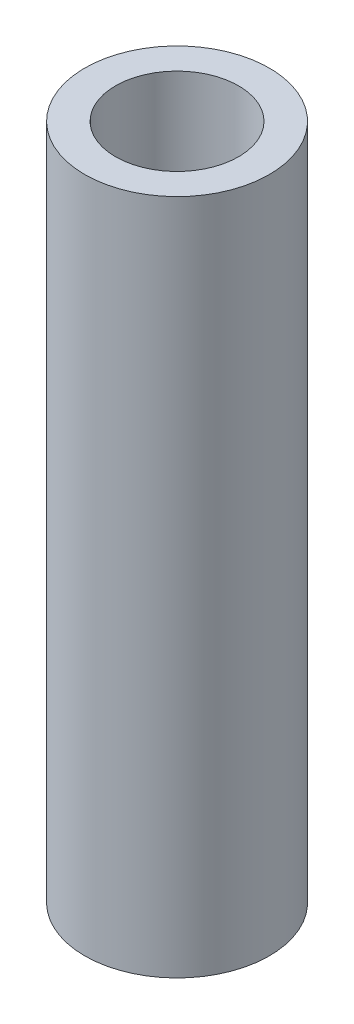
ISO-10303-21;
HEADER;
FILE_DESCRIPTION(('STEP AP214'),'2;1');
FILE_NAME('part.step','',(''),(''),'','','');
FILE_SCHEMA(('AUTOMOTIVE_DESIGN { 1 0 10303 214 1 1 1 1 }'));
ENDSEC;
DATA;
#1=APPLICATION_CONTEXT('core data for automotive mechanical design processes');
#2=APPLICATION_PROTOCOL_DEFINITION('international standard','automotive_design',2000,#1);
#3=PRODUCT_CONTEXT('',#1,'mechanical');
#4=PRODUCT('Part','Part','',(#3));
#5=PRODUCT_RELATED_PRODUCT_CATEGORY('part','',(#4));
#6=PRODUCT_DEFINITION_FORMATION('','',#4);
#7=PRODUCT_DEFINITION_CONTEXT('part definition',#1,'design');
#8=PRODUCT_DEFINITION('design','',#6,#7);
#9=PRODUCT_DEFINITION_SHAPE('','',#8);
#10=(LENGTH_UNIT() NAMED_UNIT(*) SI_UNIT(.MILLI.,.METRE.));
#11=(NAMED_UNIT(*) PLANE_ANGLE_UNIT() SI_UNIT($,.RADIAN.));
#12=(NAMED_UNIT(*) SI_UNIT($,.STERADIAN.) SOLID_ANGLE_UNIT());
#13=UNCERTAINTY_MEASURE_WITH_UNIT(LENGTH_MEASURE(1.E-05),#10,'distance_accuracy_value','');
#14=(GEOMETRIC_REPRESENTATION_CONTEXT(3) GLOBAL_UNCERTAINTY_ASSIGNED_CONTEXT((#13)) GLOBAL_UNIT_ASSIGNED_CONTEXT((#10,
#11,#12)) REPRESENTATION_CONTEXT('',''));
#15=CARTESIAN_POINT('',(0.,0.,0.));
#16=DIRECTION('',(0.,0.,1.));
#17=DIRECTION('',(1.,0.,0.));
#18=AXIS2_PLACEMENT_3D('',#15,#16,#17);
#19=CARTESIAN_POINT('',(0.,22.,0.));
#20=DIRECTION('',(0.,1.,0.));
#21=DIRECTION('',(0.,0.,1.));
#22=AXIS2_PLACEMENT_3D('',#19,#20,#21);
#23=PLANE('',#22);
#24=CARTESIAN_POINT('',(0.,22.,0.));
#25=DIRECTION('',(0.,1.,0.));
#26=DIRECTION('',(0.,0.,1.));
#27=AXIS2_PLACEMENT_3D('',#24,#25,#26);
#28=CIRCLE('',#27,3.);
#29=CARTESIAN_POINT('',(0.,22.,3.));
#30=VERTEX_POINT('',#29);
#31=EDGE_CURVE('E10',#30,#30,#28,.T.);
#32=ORIENTED_EDGE('',*,*,#31,.T.);
#33=EDGE_LOOP('',(#32));
#34=FACE_BOUND('',#33,.T.);
#35=CARTESIAN_POINT('',(0.,22.,0.));
#36=DIRECTION('',(0.,1.,0.));
#37=DIRECTION('',(0.,0.,1.));
#38=AXIS2_PLACEMENT_3D('',#35,#36,#37);
#39=CIRCLE('',#38,2.);
#40=CARTESIAN_POINT('',(0.,22.,2.));
#41=VERTEX_POINT('',#40);
#42=EDGE_CURVE('E43',#41,#41,#39,.T.);
#43=ORIENTED_EDGE('',*,*,#42,.F.);
#44=EDGE_LOOP('',(#43));
#45=FACE_BOUND('',#44,.T.);
#46=ADVANCED_FACE('F32',(#34,#45),#23,.T.);
#47=CARTESIAN_POINT('',(0.,0.,0.));
#48=DIRECTION('',(0.,1.,0.));
#49=DIRECTION('',(0.,0.,1.));
#50=AXIS2_PLACEMENT_3D('',#47,#48,#49);
#51=PLANE('',#50);
#52=CARTESIAN_POINT('',(0.,0.,0.));
#53=DIRECTION('',(0.,1.,0.));
#54=DIRECTION('',(0.,0.,1.));
#55=AXIS2_PLACEMENT_3D('',#52,#53,#54);
#56=CIRCLE('',#55,3.);
#57=CARTESIAN_POINT('',(0.,0.,3.));
#58=VERTEX_POINT('',#57);
#59=EDGE_CURVE('E36',#58,#58,#56,.T.);
#60=ORIENTED_EDGE('',*,*,#59,.F.);
#61=EDGE_LOOP('',(#60));
#62=FACE_BOUND('',#61,.T.);
#63=CARTESIAN_POINT('',(0.,0.,0.));
#64=DIRECTION('',(0.,1.,0.));
#65=DIRECTION('',(0.,0.,1.));
#66=AXIS2_PLACEMENT_3D('',#63,#64,#65);
#67=CIRCLE('',#66,2.);
#68=CARTESIAN_POINT('',(0.,0.,2.));
#69=VERTEX_POINT('',#68);
#70=EDGE_CURVE('E45',#69,#69,#67,.T.);
#71=ORIENTED_EDGE('',*,*,#70,.T.);
#72=EDGE_LOOP('',(#71));
#73=FACE_BOUND('',#72,.T.);
#74=ADVANCED_FACE('F55',(#62,#73),#51,.F.);
#75=CARTESIAN_POINT('',(0.,22.,0.));
#76=DIRECTION('',(0.,-1.,0.));
#77=DIRECTION('',(0.,0.,-1.));
#78=AXIS2_PLACEMENT_3D('',#75,#76,#77);
#79=CYLINDRICAL_SURFACE('',#78,3.);
#80=ORIENTED_EDGE('',*,*,#31,.F.);
#81=EDGE_LOOP('',(#80));
#82=FACE_BOUND('',#81,.T.);
#83=ORIENTED_EDGE('',*,*,#59,.T.);
#84=EDGE_LOOP('',(#83));
#85=FACE_BOUND('',#84,.T.);
#86=ADVANCED_FACE('F34',(#82,#85),#79,.T.);
#87=CARTESIAN_POINT('',(0.,22.,0.));
#88=DIRECTION('',(0.,-1.,0.));
#89=DIRECTION('',(0.,0.,-1.));
#90=AXIS2_PLACEMENT_3D('',#87,#88,#89);
#91=CYLINDRICAL_SURFACE('',#90,2.);
#92=ORIENTED_EDGE('',*,*,#42,.T.);
#93=EDGE_LOOP('',(#92));
#94=FACE_BOUND('',#93,.T.);
#95=ORIENTED_EDGE('',*,*,#70,.F.);
#96=EDGE_LOOP('',(#95));
#97=FACE_BOUND('',#96,.T.);
#98=ADVANCED_FACE('F51',(#94,#97),#91,.F.);
#99=CLOSED_SHELL('',(#46,#74,#86,#98));
#100=MANIFOLD_SOLID_BREP('B2',#99);
#101=ADVANCED_BREP_SHAPE_REPRESENTATION('',(#18,#100),#14);
#102=SHAPE_DEFINITION_REPRESENTATION(#9,#101);
ENDSEC;
END-ISO-10303-21;
